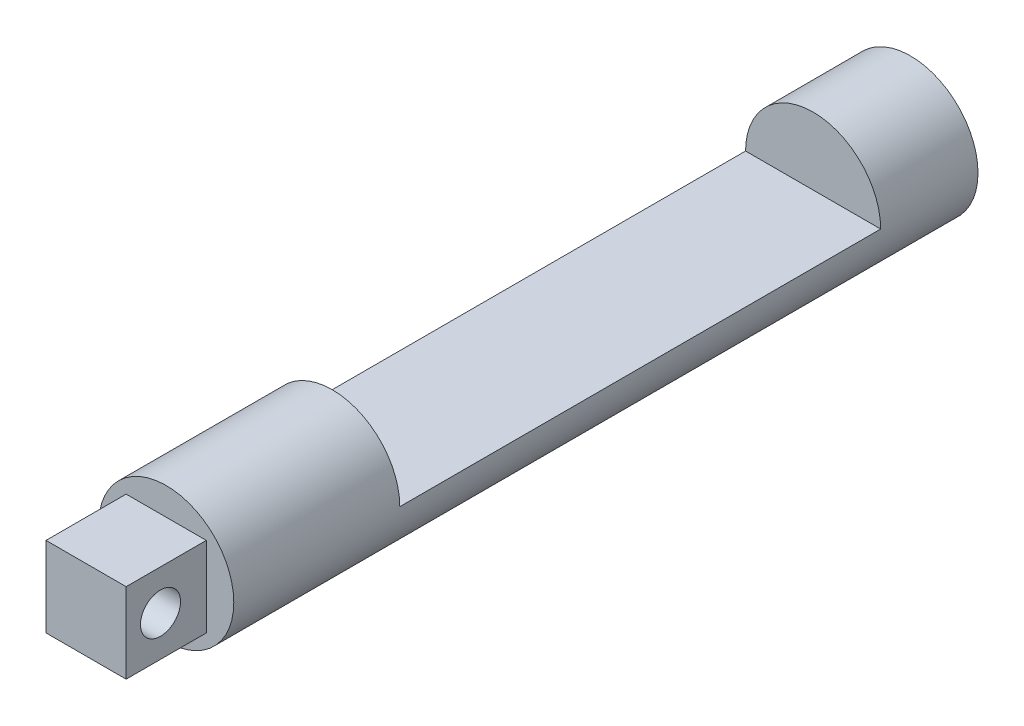
ISO-10303-21;
HEADER;
FILE_DESCRIPTION(('STEP AP214'),'2;1');
FILE_NAME('part.step','',(''),(''),'','','');
FILE_SCHEMA(('AUTOMOTIVE_DESIGN { 1 0 10303 214 1 1 1 1 }'));
ENDSEC;
DATA;
#1=APPLICATION_CONTEXT('core data for automotive mechanical design processes');
#2=APPLICATION_PROTOCOL_DEFINITION('international standard','automotive_design',2000,#1);
#3=PRODUCT_CONTEXT('',#1,'mechanical');
#4=PRODUCT('Part','Part','',(#3));
#5=PRODUCT_RELATED_PRODUCT_CATEGORY('part','',(#4));
#6=PRODUCT_DEFINITION_FORMATION('','',#4);
#7=PRODUCT_DEFINITION_CONTEXT('part definition',#1,'design');
#8=PRODUCT_DEFINITION('design','',#6,#7);
#9=PRODUCT_DEFINITION_SHAPE('','',#8);
#10=(LENGTH_UNIT() NAMED_UNIT(*) SI_UNIT(.MILLI.,.METRE.));
#11=(NAMED_UNIT(*) PLANE_ANGLE_UNIT() SI_UNIT($,.RADIAN.));
#12=(NAMED_UNIT(*) SI_UNIT($,.STERADIAN.) SOLID_ANGLE_UNIT());
#13=UNCERTAINTY_MEASURE_WITH_UNIT(LENGTH_MEASURE(1.E-05),#10,'distance_accuracy_value','');
#14=(GEOMETRIC_REPRESENTATION_CONTEXT(3) GLOBAL_UNCERTAINTY_ASSIGNED_CONTEXT((#13)) GLOBAL_UNIT_ASSIGNED_CONTEXT((#10,
#11,#12)) REPRESENTATION_CONTEXT('',''));
#15=CARTESIAN_POINT('',(0.,0.,0.));
#16=DIRECTION('',(0.,0.,1.));
#17=DIRECTION('',(1.,0.,0.));
#18=AXIS2_PLACEMENT_3D('',#15,#16,#17);
#19=CARTESIAN_POINT('',(0.,0.,32.5));
#20=DIRECTION('',(0.,0.,-1.));
#21=DIRECTION('',(-1.,0.,0.));
#22=AXIS2_PLACEMENT_3D('',#19,#20,#21);
#23=CYLINDRICAL_SURFACE('',#22,5.9);
#24=CARTESIAN_POINT('',(0.,0.,32.5));
#25=DIRECTION('',(0.,0.,1.));
#26=DIRECTION('',(1.,0.,0.));
#27=AXIS2_PLACEMENT_3D('',#24,#25,#26);
#28=CIRCLE('',#27,5.9);
#29=CARTESIAN_POINT('',(5.9,0.,32.5));
#30=VERTEX_POINT('',#29);
#31=EDGE_CURVE('E12',#30,#30,#28,.T.);
#32=ORIENTED_EDGE('',*,*,#31,.F.);
#33=EDGE_LOOP('',(#32));
#34=FACE_BOUND('',#33,.T.);
#35=CARTESIAN_POINT('',(0.,0.,-32.5));
#36=DIRECTION('',(0.,0.,1.));
#37=DIRECTION('',(1.,0.,0.));
#38=AXIS2_PLACEMENT_3D('',#35,#36,#37);
#39=CIRCLE('',#38,5.9);
#40=CARTESIAN_POINT('',(5.9,0.,-32.5));
#41=VERTEX_POINT('',#40);
#42=EDGE_CURVE('E50',#41,#41,#39,.T.);
#43=ORIENTED_EDGE('',*,*,#42,.T.);
#44=EDGE_LOOP('',(#43));
#45=FACE_BOUND('',#44,.T.);
#46=DIRECTION('',(0.,0.,1.));
#47=VECTOR('',#46,1.);
#48=CARTESIAN_POINT('',(5.9,0.,-24.));
#49=LINE('',#48,#47);
#50=CARTESIAN_POINT('',(5.9,0.,-24.));
#51=VERTEX_POINT('',#50);
#52=CARTESIAN_POINT('',(5.9,0.,18.));
#53=VERTEX_POINT('',#52);
#54=EDGE_CURVE('E110',#51,#53,#49,.T.);
#55=ORIENTED_EDGE('',*,*,#54,.T.);
#56=CARTESIAN_POINT('',(0.,0.,18.));
#57=DIRECTION('',(0.,0.,1.));
#58=DIRECTION('',(1.,0.,0.));
#59=AXIS2_PLACEMENT_3D('',#56,#57,#58);
#60=CIRCLE('',#59,5.9);
#61=CARTESIAN_POINT('',(-5.9,0.,18.));
#62=VERTEX_POINT('',#61);
#63=EDGE_CURVE('E114',#53,#62,#60,.T.);
#64=ORIENTED_EDGE('',*,*,#63,.T.);
#65=DIRECTION('',(0.,0.,1.));
#66=VECTOR('',#65,1.);
#67=CARTESIAN_POINT('',(-5.9,0.,-24.));
#68=LINE('',#67,#66);
#69=CARTESIAN_POINT('',(-5.9,0.,-24.));
#70=VERTEX_POINT('',#69);
#71=EDGE_CURVE('E99',#70,#62,#68,.T.);
#72=ORIENTED_EDGE('',*,*,#71,.F.);
#73=CARTESIAN_POINT('',(0.,0.,-24.));
#74=DIRECTION('',(0.,0.,1.));
#75=DIRECTION('',(1.,0.,0.));
#76=AXIS2_PLACEMENT_3D('',#73,#74,#75);
#77=CIRCLE('',#76,5.9);
#78=EDGE_CURVE('E182',#51,#70,#77,.T.);
#79=ORIENTED_EDGE('',*,*,#78,.F.);
#80=EDGE_LOOP('',(#55,#64,#72,#79));
#81=FACE_BOUND('',#80,.T.);
#82=ADVANCED_FACE('F47',(#34,#45,#81),#23,.T.);
#83=CARTESIAN_POINT('',(0.,0.,32.5));
#84=DIRECTION('',(0.,0.,1.));
#85=DIRECTION('',(1.,0.,0.));
#86=AXIS2_PLACEMENT_3D('',#83,#84,#85);
#87=PLANE('',#86);
#88=DIRECTION('',(0.,1.,0.));
#89=VECTOR('',#88,1.);
#90=CARTESIAN_POINT('',(3.5,3.5,32.5));
#91=LINE('',#90,#89);
#92=CARTESIAN_POINT('',(3.5,-3.5,32.5));
#93=VERTEX_POINT('',#92);
#94=CARTESIAN_POINT('',(3.5,3.5,32.5));
#95=VERTEX_POINT('',#94);
#96=EDGE_CURVE('E62',#93,#95,#91,.T.);
#97=ORIENTED_EDGE('',*,*,#96,.F.);
#98=DIRECTION('',(1.,0.,0.));
#99=VECTOR('',#98,1.);
#100=CARTESIAN_POINT('',(-3.5,-3.5,32.5));
#101=LINE('',#100,#99);
#102=CARTESIAN_POINT('',(-3.5,-3.5,32.5));
#103=VERTEX_POINT('',#102);
#104=EDGE_CURVE('E66',#103,#93,#101,.T.);
#105=ORIENTED_EDGE('',*,*,#104,.F.);
#106=DIRECTION('',(0.,-1.,0.));
#107=VECTOR('',#106,1.);
#108=CARTESIAN_POINT('',(-3.5,3.5,32.5));
#109=LINE('',#108,#107);
#110=CARTESIAN_POINT('',(-3.5,3.5,32.5));
#111=VERTEX_POINT('',#110);
#112=EDGE_CURVE('E149',#111,#103,#109,.T.);
#113=ORIENTED_EDGE('',*,*,#112,.F.);
#114=DIRECTION('',(-1.,0.,0.));
#115=VECTOR('',#114,1.);
#116=CARTESIAN_POINT('',(-3.5,3.5,32.5));
#117=LINE('',#116,#115);
#118=EDGE_CURVE('E145',#95,#111,#117,.T.);
#119=ORIENTED_EDGE('',*,*,#118,.F.);
#120=EDGE_LOOP('',(#97,#105,#113,#119));
#121=FACE_BOUND('',#120,.T.);
#122=ORIENTED_EDGE('',*,*,#31,.T.);
#123=EDGE_LOOP('',(#122));
#124=FACE_BOUND('',#123,.T.);
#125=ADVANCED_FACE('F197',(#121,#124),#87,.T.);
#126=CARTESIAN_POINT('',(0.,0.,-32.5));
#127=DIRECTION('',(0.,0.,1.));
#128=DIRECTION('',(1.,0.,0.));
#129=AXIS2_PLACEMENT_3D('',#126,#127,#128);
#130=PLANE('',#129);
#131=ORIENTED_EDGE('',*,*,#42,.F.);
#132=EDGE_LOOP('',(#131));
#133=FACE_BOUND('',#132,.T.);
#134=ADVANCED_FACE('F195',(#133),#130,.F.);
#135=CARTESIAN_POINT('',(-5.9,0.,-24.));
#136=DIRECTION('',(0.,-1.,0.));
#137=DIRECTION('',(0.,0.,-1.));
#138=AXIS2_PLACEMENT_3D('',#135,#136,#137);
#139=PLANE('',#138);
#140=ORIENTED_EDGE('',*,*,#71,.T.);
#141=DIRECTION('',(1.,0.,0.));
#142=VECTOR('',#141,1.);
#143=CARTESIAN_POINT('',(-5.9,0.,18.));
#144=LINE('',#143,#142);
#145=EDGE_CURVE('E102',#62,#53,#144,.T.);
#146=ORIENTED_EDGE('',*,*,#145,.T.);
#147=ORIENTED_EDGE('',*,*,#54,.F.);
#148=DIRECTION('',(1.,0.,0.));
#149=VECTOR('',#148,1.);
#150=CARTESIAN_POINT('',(-5.9,0.,-24.));
#151=LINE('',#150,#149);
#152=EDGE_CURVE('E105',#70,#51,#151,.T.);
#153=ORIENTED_EDGE('',*,*,#152,.F.);
#154=EDGE_LOOP('',(#140,#146,#147,#153));
#155=FACE_BOUND('',#154,.T.);
#156=ADVANCED_FACE('F101',(#155),#139,.F.);
#157=CARTESIAN_POINT('',(0.,0.,-24.));
#158=DIRECTION('',(0.,0.,1.));
#159=DIRECTION('',(1.,0.,0.));
#160=AXIS2_PLACEMENT_3D('',#157,#158,#159);
#161=PLANE('',#160);
#162=ORIENTED_EDGE('',*,*,#78,.T.);
#163=ORIENTED_EDGE('',*,*,#152,.T.);
#164=EDGE_LOOP('',(#162,#163));
#165=FACE_BOUND('',#164,.T.);
#166=ADVANCED_FACE('F202',(#165),#161,.T.);
#167=CARTESIAN_POINT('',(3.5,3.5,39.5));
#168=DIRECTION('',(-1.,0.,0.));
#169=DIRECTION('',(0.,-1.,0.));
#170=AXIS2_PLACEMENT_3D('',#167,#168,#169);
#171=PLANE('',#170);
#172=CARTESIAN_POINT('',(3.5,0.,36.5));
#173=DIRECTION('',(-1.,0.,0.));
#174=DIRECTION('',(0.,-1.,0.));
#175=AXIS2_PLACEMENT_3D('',#172,#173,#174);
#176=CIRCLE('',#175,1.75);
#177=CARTESIAN_POINT('',(3.5,-1.75,36.5));
#178=VERTEX_POINT('',#177);
#179=EDGE_CURVE('E126',#178,#178,#176,.T.);
#180=ORIENTED_EDGE('',*,*,#179,.T.);
#181=EDGE_LOOP('',(#180));
#182=FACE_BOUND('',#181,.T.);
#183=ORIENTED_EDGE('',*,*,#96,.T.);
#184=DIRECTION('',(0.,0.,-1.));
#185=VECTOR('',#184,1.);
#186=CARTESIAN_POINT('',(3.5,3.5,39.5));
#187=LINE('',#186,#185);
#188=CARTESIAN_POINT('',(3.5,3.5,39.5));
#189=VERTEX_POINT('',#188);
#190=EDGE_CURVE('E165',#189,#95,#187,.T.);
#191=ORIENTED_EDGE('',*,*,#190,.F.);
#192=DIRECTION('',(0.,1.,0.));
#193=VECTOR('',#192,1.);
#194=CARTESIAN_POINT('',(3.5,3.5,39.5));
#195=LINE('',#194,#193);
#196=CARTESIAN_POINT('',(3.5,-3.5,39.5));
#197=VERTEX_POINT('',#196);
#198=EDGE_CURVE('E130',#197,#189,#195,.T.);
#199=ORIENTED_EDGE('',*,*,#198,.F.);
#200=DIRECTION('',(0.,0.,-1.));
#201=VECTOR('',#200,1.);
#202=CARTESIAN_POINT('',(3.5,-3.5,39.5));
#203=LINE('',#202,#201);
#204=EDGE_CURVE('E142',#197,#93,#203,.T.);
#205=ORIENTED_EDGE('',*,*,#204,.T.);
#206=EDGE_LOOP('',(#183,#191,#199,#205));
#207=FACE_BOUND('',#206,.T.);
#208=ADVANCED_FACE('F232',(#182,#207),#171,.F.);
#209=CARTESIAN_POINT('',(-3.5,3.5,39.5));
#210=DIRECTION('',(0.,-1.,0.));
#211=DIRECTION('',(0.,0.,-1.));
#212=AXIS2_PLACEMENT_3D('',#209,#210,#211);
#213=PLANE('',#212);
#214=ORIENTED_EDGE('',*,*,#118,.T.);
#215=DIRECTION('',(0.,0.,-1.));
#216=VECTOR('',#215,1.);
#217=CARTESIAN_POINT('',(-3.5,3.5,39.5));
#218=LINE('',#217,#216);
#219=CARTESIAN_POINT('',(-3.5,3.5,39.5));
#220=VERTEX_POINT('',#219);
#221=EDGE_CURVE('E161',#220,#111,#218,.T.);
#222=ORIENTED_EDGE('',*,*,#221,.F.);
#223=DIRECTION('',(-1.,0.,0.));
#224=VECTOR('',#223,1.);
#225=CARTESIAN_POINT('',(-3.5,3.5,39.5));
#226=LINE('',#225,#224);
#227=EDGE_CURVE('E134',#189,#220,#226,.T.);
#228=ORIENTED_EDGE('',*,*,#227,.F.);
#229=ORIENTED_EDGE('',*,*,#190,.T.);
#230=EDGE_LOOP('',(#214,#222,#228,#229));
#231=FACE_BOUND('',#230,.T.);
#232=ADVANCED_FACE('F242',(#231),#213,.F.);
#233=CARTESIAN_POINT('',(-3.5,3.5,39.5));
#234=DIRECTION('',(1.,0.,0.));
#235=DIRECTION('',(0.,1.,0.));
#236=AXIS2_PLACEMENT_3D('',#233,#234,#235);
#237=PLANE('',#236);
#238=CARTESIAN_POINT('',(-3.5,0.,36.5));
#239=DIRECTION('',(-1.,0.,0.));
#240=DIRECTION('',(0.,-1.,0.));
#241=AXIS2_PLACEMENT_3D('',#238,#239,#240);
#242=CIRCLE('',#241,1.75);
#243=CARTESIAN_POINT('',(-3.5,-1.75,36.5));
#244=VERTEX_POINT('',#243);
#245=EDGE_CURVE('E116',#244,#244,#242,.T.);
#246=ORIENTED_EDGE('',*,*,#245,.F.);
#247=EDGE_LOOP('',(#246));
#248=FACE_BOUND('',#247,.T.);
#249=ORIENTED_EDGE('',*,*,#112,.T.);
#250=DIRECTION('',(0.,0.,-1.));
#251=VECTOR('',#250,1.);
#252=CARTESIAN_POINT('',(-3.5,-3.5,39.5));
#253=LINE('',#252,#251);
#254=CARTESIAN_POINT('',(-3.5,-3.5,39.5));
#255=VERTEX_POINT('',#254);
#256=EDGE_CURVE('E157',#255,#103,#253,.T.);
#257=ORIENTED_EDGE('',*,*,#256,.F.);
#258=DIRECTION('',(0.,-1.,0.));
#259=VECTOR('',#258,1.);
#260=CARTESIAN_POINT('',(-3.5,3.5,39.5));
#261=LINE('',#260,#259);
#262=EDGE_CURVE('E136',#220,#255,#261,.T.);
#263=ORIENTED_EDGE('',*,*,#262,.F.);
#264=ORIENTED_EDGE('',*,*,#221,.T.);
#265=EDGE_LOOP('',(#249,#257,#263,#264));
#266=FACE_BOUND('',#265,.T.);
#267=ADVANCED_FACE('F252',(#248,#266),#237,.F.);
#268=CARTESIAN_POINT('',(-3.5,-3.5,39.5));
#269=DIRECTION('',(0.,1.,0.));
#270=DIRECTION('',(0.,0.,1.));
#271=AXIS2_PLACEMENT_3D('',#268,#269,#270);
#272=PLANE('',#271);
#273=ORIENTED_EDGE('',*,*,#104,.T.);
#274=ORIENTED_EDGE('',*,*,#204,.F.);
#275=DIRECTION('',(1.,0.,0.));
#276=VECTOR('',#275,1.);
#277=CARTESIAN_POINT('',(-3.5,-3.5,39.5));
#278=LINE('',#277,#276);
#279=EDGE_CURVE('E139',#255,#197,#278,.T.);
#280=ORIENTED_EDGE('',*,*,#279,.F.);
#281=ORIENTED_EDGE('',*,*,#256,.T.);
#282=EDGE_LOOP('',(#273,#274,#280,#281));
#283=FACE_BOUND('',#282,.T.);
#284=ADVANCED_FACE('F261',(#283),#272,.F.);
#285=CARTESIAN_POINT('',(0.,0.,39.5));
#286=DIRECTION('',(0.,0.,1.));
#287=DIRECTION('',(1.,0.,0.));
#288=AXIS2_PLACEMENT_3D('',#285,#286,#287);
#289=PLANE('',#288);
#290=ORIENTED_EDGE('',*,*,#198,.T.);
#291=ORIENTED_EDGE('',*,*,#227,.T.);
#292=ORIENTED_EDGE('',*,*,#262,.T.);
#293=ORIENTED_EDGE('',*,*,#279,.T.);
#294=EDGE_LOOP('',(#290,#291,#292,#293));
#295=FACE_BOUND('',#294,.T.);
#296=ADVANCED_FACE('F270',(#295),#289,.T.);
#297=CARTESIAN_POINT('',(5.9,0.,36.5));
#298=DIRECTION('',(-1.,0.,0.));
#299=DIRECTION('',(0.,-1.,0.));
#300=AXIS2_PLACEMENT_3D('',#297,#298,#299);
#301=CYLINDRICAL_SURFACE('',#300,1.75);
#302=ORIENTED_EDGE('',*,*,#245,.T.);
#303=EDGE_LOOP('',(#302));
#304=FACE_BOUND('',#303,.T.);
#305=ORIENTED_EDGE('',*,*,#179,.F.);
#306=EDGE_LOOP('',(#305));
#307=FACE_BOUND('',#306,.T.);
#308=ADVANCED_FACE('F278',(#304,#307),#301,.F.);
#309=CARTESIAN_POINT('',(0.,0.,18.));
#310=DIRECTION('',(0.,0.,1.));
#311=DIRECTION('',(1.,0.,0.));
#312=AXIS2_PLACEMENT_3D('',#309,#310,#311);
#313=PLANE('',#312);
#314=ORIENTED_EDGE('',*,*,#63,.F.);
#315=ORIENTED_EDGE('',*,*,#145,.F.);
#316=EDGE_LOOP('',(#314,#315));
#317=FACE_BOUND('',#316,.T.);
#318=ADVANCED_FACE('F113',(#317),#313,.F.);
#319=CLOSED_SHELL('',(#82,#125,#134,#156,#166,#208,#232,#267,#284,#296,#308,#318));
#320=CARTESIAN_POINT('',(0.,0.,23.));
#321=DIRECTION('',(0.,0.,1.));
#322=DIRECTION('',(1.,0.,0.));
#323=AXIS2_PLACEMENT_3D('',#320,#321,#322);
#324=CYLINDRICAL_SURFACE('',#323,5.8);
#325=CARTESIAN_POINT('',(0.,0.,23.));
#326=DIRECTION('',(0.,0.,1.));
#327=DIRECTION('',(1.,0.,0.));
#328=AXIS2_PLACEMENT_3D('',#325,#326,#327);
#329=CIRCLE('',#328,5.8);
#330=CARTESIAN_POINT('',(5.8,0.,23.));
#331=VERTEX_POINT('',#330);
#332=EDGE_CURVE('E178',#331,#331,#329,.T.);
#333=ORIENTED_EDGE('',*,*,#332,.F.);
#334=EDGE_LOOP('',(#333));
#335=FACE_BOUND('',#334,.T.);
#336=CARTESIAN_POINT('',(0.,0.,26.));
#337=DIRECTION('',(0.,0.,1.));
#338=DIRECTION('',(1.,0.,0.));
#339=AXIS2_PLACEMENT_3D('',#336,#337,#338);
#340=CIRCLE('',#339,5.8);
#341=CARTESIAN_POINT('',(5.8,0.,26.));
#342=VERTEX_POINT('',#341);
#343=EDGE_CURVE('E174',#342,#342,#340,.T.);
#344=ORIENTED_EDGE('',*,*,#343,.T.);
#345=EDGE_LOOP('',(#344));
#346=FACE_BOUND('',#345,.T.);
#347=ADVANCED_FACE('F298',(#335,#346),#324,.F.);
#348=CARTESIAN_POINT('',(0.,0.,23.));
#349=DIRECTION('',(0.,0.,1.));
#350=DIRECTION('',(1.,0.,0.));
#351=AXIS2_PLACEMENT_3D('',#348,#349,#350);
#352=PLANE('',#351);
#353=CARTESIAN_POINT('',(0.,0.,23.));
#354=DIRECTION('',(0.,0.,1.));
#355=DIRECTION('',(1.,0.,0.));
#356=AXIS2_PLACEMENT_3D('',#353,#354,#355);
#357=CIRCLE('',#356,5.);
#358=CARTESIAN_POINT('',(5.,0.,23.));
#359=VERTEX_POINT('',#358);
#360=EDGE_CURVE('E170',#359,#359,#357,.T.);
#361=ORIENTED_EDGE('',*,*,#360,.F.);
#362=EDGE_LOOP('',(#361));
#363=FACE_BOUND('',#362,.T.);
#364=ORIENTED_EDGE('',*,*,#332,.T.);
#365=EDGE_LOOP('',(#364));
#366=FACE_BOUND('',#365,.T.);
#367=ADVANCED_FACE('F300',(#363,#366),#352,.T.);
#368=CARTESIAN_POINT('',(0.,0.,26.));
#369=DIRECTION('',(0.,0.,1.));
#370=DIRECTION('',(1.,0.,0.));
#371=AXIS2_PLACEMENT_3D('',#368,#369,#370);
#372=PLANE('',#371);
#373=CARTESIAN_POINT('',(0.,0.,26.));
#374=DIRECTION('',(0.,0.,1.));
#375=DIRECTION('',(1.,0.,0.));
#376=AXIS2_PLACEMENT_3D('',#373,#374,#375);
#377=CIRCLE('',#376,5.);
#378=CARTESIAN_POINT('',(5.,0.,26.));
#379=VERTEX_POINT('',#378);
#380=EDGE_CURVE('E169',#379,#379,#377,.T.);
#381=ORIENTED_EDGE('',*,*,#380,.T.);
#382=EDGE_LOOP('',(#381));
#383=FACE_BOUND('',#382,.T.);
#384=ORIENTED_EDGE('',*,*,#343,.F.);
#385=EDGE_LOOP('',(#384));
#386=FACE_BOUND('',#385,.T.);
#387=ADVANCED_FACE('F310',(#383,#386),#372,.F.);
#388=CARTESIAN_POINT('',(0.,0.,23.));
#389=DIRECTION('',(0.,0.,1.));
#390=DIRECTION('',(1.,0.,0.));
#391=AXIS2_PLACEMENT_3D('',#388,#389,#390);
#392=CYLINDRICAL_SURFACE('',#391,5.);
#393=ORIENTED_EDGE('',*,*,#360,.T.);
#394=EDGE_LOOP('',(#393));
#395=FACE_BOUND('',#394,.T.);
#396=ORIENTED_EDGE('',*,*,#380,.F.);
#397=EDGE_LOOP('',(#396));
#398=FACE_BOUND('',#397,.T.);
#399=ADVANCED_FACE('F319',(#395,#398),#392,.T.);
#400=CLOSED_SHELL('',(#347,#367,#387,#399));
#401=ORIENTED_CLOSED_SHELL('',*,#400,.T.);
#402=BREP_WITH_VOIDS('B2',#319,(#401));
#403=ADVANCED_BREP_SHAPE_REPRESENTATION('',(#18,#402),#14);
#404=SHAPE_DEFINITION_REPRESENTATION(#9,#403);
ENDSEC;
END-ISO-10303-21;
